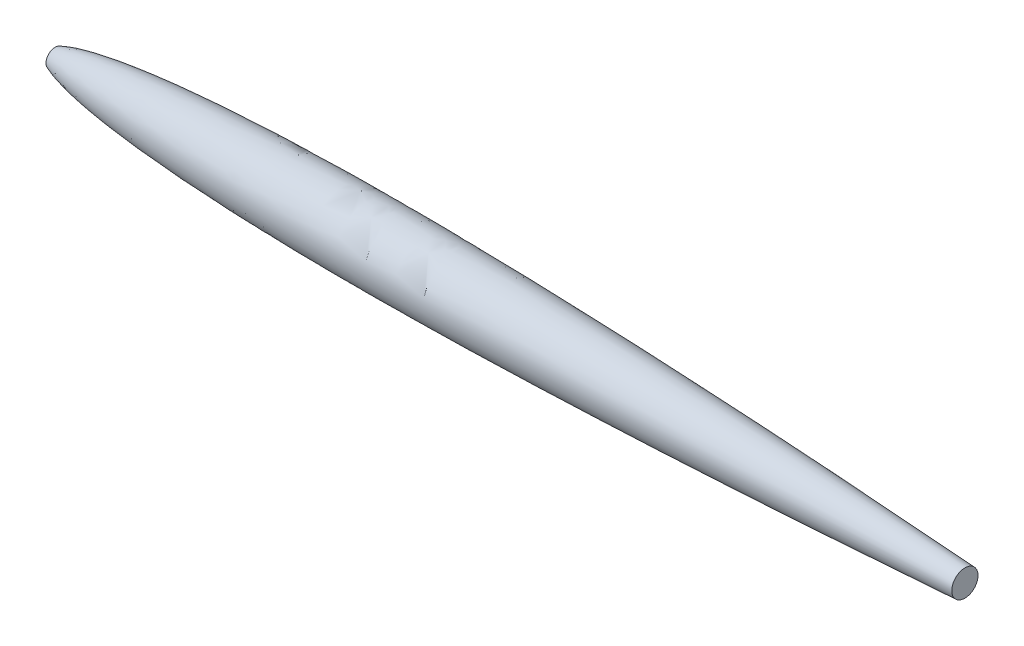
ISO-10303-21;
HEADER;
FILE_DESCRIPTION(('STEP AP214'),'2;1');
FILE_NAME('part.step','',(''),(''),'','','');
FILE_SCHEMA(('AUTOMOTIVE_DESIGN { 1 0 10303 214 1 1 1 1 }'));
ENDSEC;
DATA;
#1=APPLICATION_CONTEXT('core data for automotive mechanical design processes');
#2=APPLICATION_PROTOCOL_DEFINITION('international standard','automotive_design',2000,#1);
#3=PRODUCT_CONTEXT('',#1,'mechanical');
#4=PRODUCT('Part','Part','',(#3));
#5=PRODUCT_RELATED_PRODUCT_CATEGORY('part','',(#4));
#6=PRODUCT_DEFINITION_FORMATION('','',#4);
#7=PRODUCT_DEFINITION_CONTEXT('part definition',#1,'design');
#8=PRODUCT_DEFINITION('design','',#6,#7);
#9=PRODUCT_DEFINITION_SHAPE('','',#8);
#10=(LENGTH_UNIT() NAMED_UNIT(*) SI_UNIT(.MILLI.,.METRE.));
#11=(NAMED_UNIT(*) PLANE_ANGLE_UNIT() SI_UNIT($,.RADIAN.));
#12=(NAMED_UNIT(*) SI_UNIT($,.STERADIAN.) SOLID_ANGLE_UNIT());
#13=UNCERTAINTY_MEASURE_WITH_UNIT(LENGTH_MEASURE(1.E-05),#10,'distance_accuracy_value','');
#14=(GEOMETRIC_REPRESENTATION_CONTEXT(3) GLOBAL_UNCERTAINTY_ASSIGNED_CONTEXT((#13)) GLOBAL_UNIT_ASSIGNED_CONTEXT((#10,
#11,#12)) REPRESENTATION_CONTEXT('',''));
#15=CARTESIAN_POINT('',(0.,0.,0.));
#16=DIRECTION('',(0.,0.,1.));
#17=DIRECTION('',(1.,0.,0.));
#18=AXIS2_PLACEMENT_3D('',#15,#16,#17);
#19=CARTESIAN_POINT('',(10999.9999999114,0.,-6.43708127694486E-09));
#20=CARTESIAN_POINT('',(10993.9727306901,0.,-0.438031797088573));
#21=CARTESIAN_POINT('',(10981.8032504732,0.,-1.32144289600741));
#22=CARTESIAN_POINT('',(10958.8710367509,0.,-2.98352274322804));
#23=CARTESIAN_POINT('',(10934.3368481594,0.,-4.75453023288062));
#24=CARTESIAN_POINT('',(10900.2084233248,0.,-7.21234567680039));
#25=CARTESIAN_POINT('',(10861.0394153717,0.,-10.0201321720221));
#26=CARTESIAN_POINT('',(10814.2581571265,0.,-13.3575019726778));
#27=CARTESIAN_POINT('',(10761.4535922365,0.,-17.1003804288576));
#28=CARTESIAN_POINT('',(10708.2897318897,0.,-20.8462837145694));
#29=CARTESIAN_POINT('',(10655.3329451982,0.,-24.5542716647989));
#30=CARTESIAN_POINT('',(10602.249493916,0.,-28.248814521459));
#31=CARTESIAN_POINT('',(10549.2401673054,0.,-31.9155308261855));
#32=CARTESIAN_POINT('',(10496.1834192708,0.,-35.5634599237538));
#33=CARTESIAN_POINT('',(10443.1529904408,0.,-39.1874437503906));
#34=CARTESIAN_POINT('',(10390.1042798018,0.,-42.7909197834185));
#35=CARTESIAN_POINT('',(10337.0641434928,0.,-46.3721273641647));
#36=CARTESIAN_POINT('',(10284.0167615835,0.,-49.9324023741986));
#37=CARTESIAN_POINT('',(10230.9710465342,0.,-53.4712782182235));
#38=CARTESIAN_POINT('',(10138.1363511123,0.,-59.6277238807782));
#39=CARTESIAN_POINT('',(10032.0349969403,0.,-66.5802700900151));
#40=CARTESIAN_POINT('',(9912.66332687831,0.,-74.2947340481952));
#41=CARTESIAN_POINT('',(9780.0200085779,0.,-82.7330976147289));
#42=CARTESIAN_POINT('',(9673.90020370212,0.,-89.4049347782293));
#43=CARTESIAN_POINT('',(9541.24447252994,0.,-97.6473828977432));
#44=CARTESIAN_POINT('',(9382.04802790126,0.,-107.384401539987));
#45=CARTESIAN_POINT('',(9196.30547929109,0.,-118.523403251807));
#46=CARTESIAN_POINT('',(8984.01062255047,0.,-130.956090450395));
#47=CARTESIAN_POINT('',(8771.69878438221,0.,-143.095088026498));
#48=CARTESIAN_POINT('',(8506.28841889144,0.,-157.9048846195));
#49=CARTESIAN_POINT('',(8187.76401561209,0.,-175.096544248704));
#50=CARTESIAN_POINT('',(7816.10723978569,0.,-194.306117475576));
#51=CARTESIAN_POINT('',(7391.29684687631,0.,-215.071528970679));
#52=CARTESIAN_POINT('',(6966.42760979841,0.,-234.597307497891));
#53=CARTESIAN_POINT('',(6541.49978351588,0.,-252.805736724156));
#54=CARTESIAN_POINT('',(6116.51321361754,0.,-269.590680129271));
#55=CARTESIAN_POINT('',(5691.46768933378,0.,-284.815055747022));
#56=CARTESIAN_POINT('',(5266.36340457883,0.,-298.307410519293));
#57=CARTESIAN_POINT('',(4841.20155804878,0.,-309.857365651042));
#58=CARTESIAN_POINT('',(4415.98520152772,0.,-319.209100207951));
#59=CARTESIAN_POINT('',(3990.72040314142,0.,-326.052290467533));
#60=CARTESIAN_POINT('',(3618.58081240911,0.,-329.513768650375));
#61=CARTESIAN_POINT('',(3299.59192293651,0.,-330.384071895175));
#62=CARTESIAN_POINT('',(3033.76918605138,0.,-329.526860496355));
#63=CARTESIAN_POINT('',(2821.11671644886,0.,-327.806853246903));
#64=CARTESIAN_POINT('',(2608.47621167468,0.,-324.955727137892));
#65=CARTESIAN_POINT('',(2395.85579901899,0.,-320.860371187195));
#66=CARTESIAN_POINT('',(2183.26607259424,0.,-315.387382687774));
#67=CARTESIAN_POINT('',(1970.72108881952,0.,-308.376208713986));
#68=CARTESIAN_POINT('',(1784.82720980626,0.,-300.723903315102));
#69=CARTESIAN_POINT('',(1625.57696457262,0.,-292.926255548081));
#70=CARTESIAN_POINT('',(1492.95401596303,0.,-285.502236935934));
#71=CARTESIAN_POINT('',(1386.93458197183,0.,-278.961621427036));
#72=CARTESIAN_POINT('',(1280.95775603708,0.,-271.761542521152));
#73=CARTESIAN_POINT('',(1175.03259637474,0.,-263.835414150813));
#74=CARTESIAN_POINT('',(1069.17063551745,0.,-255.10283842246));
#75=CARTESIAN_POINT('',(963.38698087677,0.,-245.464526813153));
#76=CARTESIAN_POINT('',(859.684753542944,0.,-234.995657417139));
#77=CARTESIAN_POINT('',(758.084154260968,0.,-223.607887378711));
#78=CARTESIAN_POINT('',(658.612232457384,0.,-211.186619601166));
#79=CARTESIAN_POINT('',(573.469223953823,0.,-199.282575083875));
#80=CARTESIAN_POINT('',(500.651651232557,0.,-187.980684512054));
#81=CARTESIAN_POINT('',(439.719156268776,0.,-177.608967602177));
#82=CARTESIAN_POINT('',(390.608018363905,0.,-168.60304735642));
#83=CARTESIAN_POINT('',(341.243287096751,0.,-158.777969552616));
#84=CARTESIAN_POINT('',(291.6730044071,0.,-147.96396892893));
#85=CARTESIAN_POINT('',(243.07019996589,0.,-136.204737596919));
#86=CARTESIAN_POINT('',(201.291019257043,0.,-124.83380423951));
#87=CARTESIAN_POINT('',(166.299503436915,0.,-114.136034238537));
#88=CARTESIAN_POINT('',(137.455558774662,0.,-104.311070441166));
#89=CARTESIAN_POINT('',(113.95778562596,0.,-95.516746755885));
#90=CARTESIAN_POINT('',(92.789267204734,0.,-86.6434979617395));
#91=CARTESIAN_POINT('',(73.9829790941119,0.,-77.7242846293616));
#92=CARTESIAN_POINT('',(57.0760693623161,0.,-68.6180711546139));
#93=CARTESIAN_POINT('',(43.3840484792573,0.,-60.1943828009551));
#94=CARTESIAN_POINT('',(32.3839476203801,0.,-52.2354073372266));
#95=CARTESIAN_POINT('',(24.0065671735061,0.,-45.0124755369172));
#96=CARTESIAN_POINT('',(18.0050550905463,0.,-39.0824364753431));
#97=CARTESIAN_POINT('',(13.8073677715887,0.,-34.3714872928397));
#98=CARTESIAN_POINT('',(9.99141312001332,0.,-29.3681315340282));
#99=CARTESIAN_POINT('',(6.61089939961276,0.,-23.9643226594275));
#100=CARTESIAN_POINT('',(4.13001991638,0.,-19.1147339577008));
#101=CARTESIAN_POINT('',(2.10965681824584,0.,-13.9384587900824));
#102=CARTESIAN_POINT('',(0.673873379266392,0.,-8.45468671085863));
#103=CARTESIAN_POINT('',(0.122535706790431,0.,-4.24076673461526));
#104=CARTESIAN_POINT('',(0.000193085103623262,0.,-1.41658200533096));
#105=CARTESIAN_POINT('',(0.,0.,0.));
#106=B_SPLINE_CURVE_WITH_KNOTS('',4,(#19,#20,#21,#22,#23,#24,#25,#26,#27,#28,#29,#30,#31,#32,
#33,#34,#35,#36,#37,#38,#39,#40,#41,#42,#43,#44,#45,#46,#47,#48,#49,#50,#51,#52,#53,#54,#55,#56,
#57,#58,#59,#60,#61,#62,#63,#64,#65,#66,#67,#68,#69,#70,#71,#72,#73,#74,#75,#76,#77,#78,#79,#80,
#81,#82,#83,#84,#85,#86,#87,#88,#89,#90,#91,#92,#93,#94,#95,#96,#97,#98,#99,#100,#101,#102,#103,
#104,#105),.UNSPECIFIED.,.F.,.F.,(5,1,1,1,1,1,1,1,1,1,1,1,1,1,1,1,1,1,1,1,1,1,1,1,1,1,1,1,1,1,1,
1,1,1,1,1,1,1,1,1,1,1,1,1,1,1,1,1,1,1,1,1,1,1,1,1,1,1,1,1,1,1,1,1,1,1,1,1,1,1,1,1,1,1,1,1,1,1,1,
1,1,1,1,5),(0.,0.00218399049332629,0.00436798098665259,0.00655197147997888,0.00873596197330506,
0.0131039429599575,0.0174719239466101,0.0218399049332627,0.0262078859199152,0.0305758669065677,
0.0349438478932202,0.0393118288798728,0.0436798098665253,0.0480477908531778,0.0524157718398304,
0.056783752826483,0.0611517338131355,0.0655197147997881,0.0698876957864406,0.0873596195907531,
0.0960955814929094,0.104831543395066,0.113567505297222,0.122303467199378,0.139775391003691,
0.157247314726167,0.174719238448643,0.192191162171119,0.209663085893595,0.244606933696528,
0.279550781499461,0.314494629065929,0.349438476632398,0.384382324291439,0.419326171950479,
0.454270019603899,0.489213867257318,0.524157714808659,0.55910156236,0.59404540992135,
0.628989257482701,0.64646118120193,0.663933104921159,0.681405028640388,0.698876952359617,
0.7163488755104,0.733820798661182,0.751292721811965,0.768764644962747,0.777491660977801,
0.786218676992855,0.794945693007909,0.803672709022963,0.812399725038017,0.821126741053071,
0.829853757068125,0.83858077308318,0.846652825380427,0.854724877677674,0.862796929974921,
0.866832956123545,0.870868982272168,0.875037162263929,0.87920534225569,0.883373522247451,
0.887541702239212,0.891468997897097,0.893432645726039,0.895396293554981,0.897554586719237,
0.899712879883493,0.900973305631297,0.902233731379101,0.903863140324877,0.904992308472623,
0.905428762244265,0.905865216015906,0.906634793353248,0.907064106863914,0.90749342037458,
0.907957873985982,0.908422327597384,0.908886781208786,0.909351234820188),.UNSPECIFIED.);
#107=CARTESIAN_POINT('',(0.,0.,0.));
#108=DIRECTION('',(-1.,0.,0.));
#109=AXIS1_PLACEMENT('',#107,#108);
#110=SURFACE_OF_REVOLUTION('',#106,#109);
#111=CARTESIAN_POINT('',(100.,0.,0.));
#112=DIRECTION('',(-1.,0.,0.));
#113=DIRECTION('',(0.,0.,1.));
#114=AXIS2_PLACEMENT_3D('',#111,#112,#113);
#115=CIRCLE('',#114,89.5421719115566);
#116=CARTESIAN_POINT('',(100.,0.,89.5421719115566));
#117=VERTEX_POINT('',#116);
#118=EDGE_CURVE('E38',#117,#117,#115,.F.);
#119=ORIENTED_EDGE('',*,*,#118,.T.);
#120=EDGE_LOOP('',(#119));
#121=FACE_BOUND('',#120,.T.);
#122=CARTESIAN_POINT('',(9020.,0.,0.));
#123=DIRECTION('',(-1.,0.,0.));
#124=DIRECTION('',(0.,0.,1.));
#125=AXIS2_PLACEMENT_3D('',#122,#123,#124);
#126=CIRCLE('',#125,128.807754302869);
#127=CARTESIAN_POINT('',(9020.,0.,128.807754302869));
#128=VERTEX_POINT('',#127);
#129=EDGE_CURVE('E10',#128,#128,#126,.F.);
#130=ORIENTED_EDGE('',*,*,#129,.F.);
#131=EDGE_LOOP('',(#130));
#132=FACE_BOUND('',#131,.T.);
#133=ADVANCED_FACE('F34',(#121,#132),#110,.T.);
#134=CARTESIAN_POINT('',(9020.,0.,0.));
#135=DIRECTION('',(1.,0.,0.));
#136=DIRECTION('',(0.,0.,-1.));
#137=AXIS2_PLACEMENT_3D('',#134,#135,#136);
#138=PLANE('',#137);
#139=ORIENTED_EDGE('',*,*,#129,.T.);
#140=EDGE_LOOP('',(#139));
#141=FACE_BOUND('',#140,.T.);
#142=ADVANCED_FACE('F57',(#141),#138,.T.);
#143=CARTESIAN_POINT('',(100.,0.,0.));
#144=DIRECTION('',(1.,0.,0.));
#145=DIRECTION('',(0.,0.,-1.));
#146=AXIS2_PLACEMENT_3D('',#143,#144,#145);
#147=PLANE('',#146);
#148=ORIENTED_EDGE('',*,*,#118,.F.);
#149=EDGE_LOOP('',(#148));
#150=FACE_BOUND('',#149,.T.);
#151=ADVANCED_FACE('F55',(#150),#147,.F.);
#152=CLOSED_SHELL('',(#133,#142,#151));
#153=MANIFOLD_SOLID_BREP('B2',#152);
#154=ADVANCED_BREP_SHAPE_REPRESENTATION('',(#18,#153),#14);
#155=SHAPE_DEFINITION_REPRESENTATION(#9,#154);
ENDSEC;
END-ISO-10303-21;
